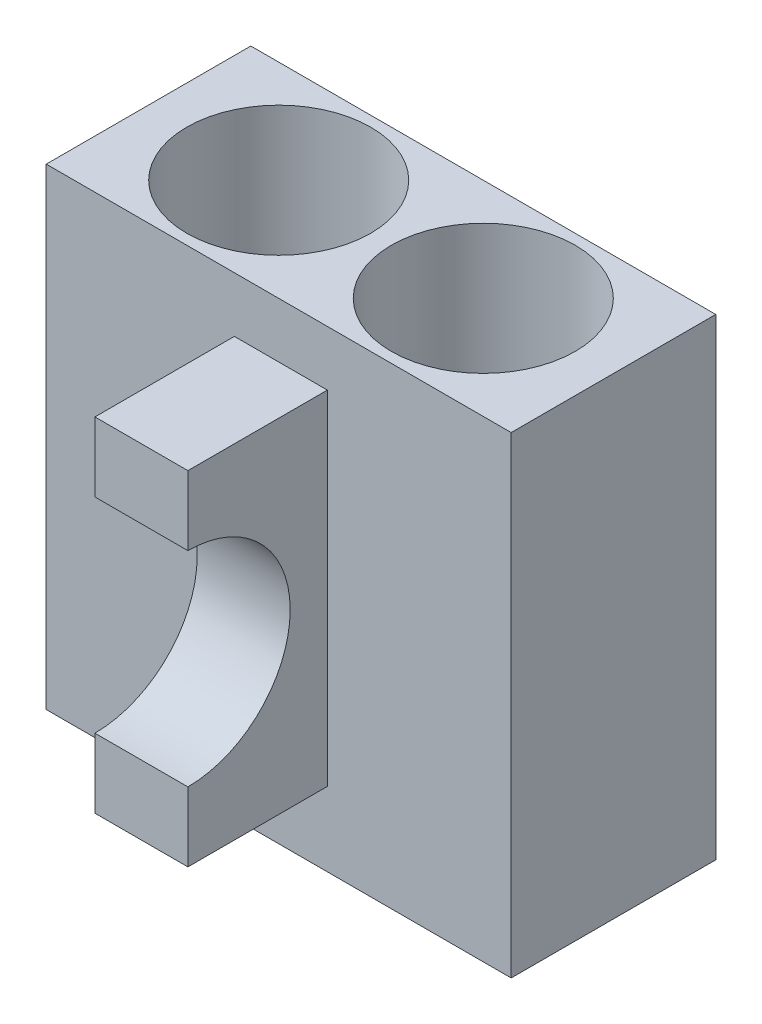
ISO-10303-21;
HEADER;
FILE_DESCRIPTION(('STEP AP214'),'2;1');
FILE_NAME('part.step','',(''),(''),'','','');
FILE_SCHEMA(('AUTOMOTIVE_DESIGN { 1 0 10303 214 1 1 1 1 }'));
ENDSEC;
DATA;
#1=APPLICATION_CONTEXT('core data for automotive mechanical design processes');
#2=APPLICATION_PROTOCOL_DEFINITION('international standard','automotive_design',2000,#1);
#3=PRODUCT_CONTEXT('',#1,'mechanical');
#4=PRODUCT('Part','Part','',(#3));
#5=PRODUCT_RELATED_PRODUCT_CATEGORY('part','',(#4));
#6=PRODUCT_DEFINITION_FORMATION('','',#4);
#7=PRODUCT_DEFINITION_CONTEXT('part definition',#1,'design');
#8=PRODUCT_DEFINITION('design','',#6,#7);
#9=PRODUCT_DEFINITION_SHAPE('','',#8);
#10=(LENGTH_UNIT() NAMED_UNIT(*) SI_UNIT(.MILLI.,.METRE.));
#11=(NAMED_UNIT(*) PLANE_ANGLE_UNIT() SI_UNIT($,.RADIAN.));
#12=(NAMED_UNIT(*) SI_UNIT($,.STERADIAN.) SOLID_ANGLE_UNIT());
#13=UNCERTAINTY_MEASURE_WITH_UNIT(LENGTH_MEASURE(1.E-05),#10,'distance_accuracy_value','');
#14=(GEOMETRIC_REPRESENTATION_CONTEXT(3) GLOBAL_UNCERTAINTY_ASSIGNED_CONTEXT((#13)) GLOBAL_UNIT_ASSIGNED_CONTEXT((#10,
#11,#12)) REPRESENTATION_CONTEXT('',''));
#15=CARTESIAN_POINT('',(0.,0.,0.));
#16=DIRECTION('',(0.,0.,1.));
#17=DIRECTION('',(1.,0.,0.));
#18=AXIS2_PLACEMENT_3D('',#15,#16,#17);
#19=CARTESIAN_POINT('',(0.,0.,26.2362852999536));
#20=DIRECTION('',(0.,0.,1.));
#21=DIRECTION('',(1.,0.,0.));
#22=AXIS2_PLACEMENT_3D('',#19,#20,#21);
#23=PLANE('',#22);
#24=DIRECTION('',(1.,0.,0.));
#25=VECTOR('',#24,1.);
#26=CARTESIAN_POINT('',(0.23138121745496,15.4165798344945,26.2362852999536));
#27=LINE('',#26,#25);
#28=CARTESIAN_POINT('',(0.23138121745496,15.4165798344945,26.2362852999536));
#29=VERTEX_POINT('',#28);
#30=CARTESIAN_POINT('',(10.231381217455,15.4165798344945,26.2362852999536));
#31=VERTEX_POINT('',#30);
#32=EDGE_CURVE('E11',#29,#31,#27,.T.);
#33=ORIENTED_EDGE('',*,*,#32,.F.);
#34=DIRECTION('',(0.,-1.,0.));
#35=VECTOR('',#34,1.);
#36=CARTESIAN_POINT('',(0.23138121745496,44.8715798344945,26.2362852999536));
#37=LINE('',#36,#35);
#38=CARTESIAN_POINT('',(0.23138121745496,7.96157983449446,26.2362852999536));
#39=VERTEX_POINT('',#38);
#40=EDGE_CURVE('E145',#29,#39,#37,.T.);
#41=ORIENTED_EDGE('',*,*,#40,.T.);
#42=DIRECTION('',(1.,0.,0.));
#43=VECTOR('',#42,1.);
#44=CARTESIAN_POINT('',(0.23138121745496,7.96157983449446,26.2362852999536));
#45=LINE('',#44,#43);
#46=CARTESIAN_POINT('',(10.231381217455,7.96157983449446,26.2362852999536));
#47=VERTEX_POINT('',#46);
#48=EDGE_CURVE('E127',#39,#47,#45,.T.);
#49=ORIENTED_EDGE('',*,*,#48,.T.);
#50=DIRECTION('',(0.,1.,0.));
#51=VECTOR('',#50,1.);
#52=CARTESIAN_POINT('',(10.231381217455,44.8715798344945,26.2362852999536));
#53=LINE('',#52,#51);
#54=EDGE_CURVE('E122',#47,#31,#53,.T.);
#55=ORIENTED_EDGE('',*,*,#54,.T.);
#56=EDGE_LOOP('',(#33,#41,#49,#55));
#57=FACE_BOUND('',#56,.T.);
#58=ADVANCED_FACE('F37',(#57),#23,.T.);
#59=CARTESIAN_POINT('',(-20.0017448058538,50.8,11.2362852999536));
#60=DIRECTION('',(0.,0.,-1.));
#61=DIRECTION('',(-1.,0.,0.));
#62=AXIS2_PLACEMENT_3D('',#59,#60,#61);
#63=PLANE('',#62);
#64=DIRECTION('',(1.,0.,0.));
#65=VECTOR('',#64,1.);
#66=CARTESIAN_POINT('',(-20.0017448058538,0.,11.2362852999536));
#67=LINE('',#66,#65);
#68=CARTESIAN_POINT('',(-20.0017448058538,0.,11.2362852999536));
#69=VERTEX_POINT('',#68);
#70=CARTESIAN_POINT('',(29.9982551941462,0.,11.2362852999536));
#71=VERTEX_POINT('',#70);
#72=EDGE_CURVE('E176',#69,#71,#67,.T.);
#73=ORIENTED_EDGE('',*,*,#72,.T.);
#74=DIRECTION('',(0.,-1.,0.));
#75=VECTOR('',#74,1.);
#76=CARTESIAN_POINT('',(29.9982551941462,50.8,11.2362852999536));
#77=LINE('',#76,#75);
#78=CARTESIAN_POINT('',(29.9982551941462,50.8,11.2362852999536));
#79=VERTEX_POINT('',#78);
#80=EDGE_CURVE('E186',#79,#71,#77,.T.);
#81=ORIENTED_EDGE('',*,*,#80,.F.);
#82=DIRECTION('',(1.,0.,0.));
#83=VECTOR('',#82,1.);
#84=CARTESIAN_POINT('',(-20.0017448058538,50.8,11.2362852999536));
#85=LINE('',#84,#83);
#86=CARTESIAN_POINT('',(-20.0017448058538,50.8,11.2362852999536));
#87=VERTEX_POINT('',#86);
#88=EDGE_CURVE('E166',#87,#79,#85,.T.);
#89=ORIENTED_EDGE('',*,*,#88,.F.);
#90=DIRECTION('',(0.,-1.,0.));
#91=VECTOR('',#90,1.);
#92=CARTESIAN_POINT('',(-20.0017448058538,50.8,11.2362852999536));
#93=LINE('',#92,#91);
#94=EDGE_CURVE('E189',#87,#69,#93,.T.);
#95=ORIENTED_EDGE('',*,*,#94,.T.);
#96=EDGE_LOOP('',(#73,#81,#89,#95));
#97=FACE_BOUND('',#96,.T.);
#98=DIRECTION('',(0.,-1.,0.));
#99=VECTOR('',#98,1.);
#100=CARTESIAN_POINT('',(0.23138121745496,44.8715798344945,11.2362852999536));
#101=LINE('',#100,#99);
#102=CARTESIAN_POINT('',(0.23138121745496,44.8715798344945,11.2362852999536));
#103=VERTEX_POINT('',#102);
#104=CARTESIAN_POINT('',(0.23138121745496,7.96157983449446,11.2362852999536));
#105=VERTEX_POINT('',#104);
#106=EDGE_CURVE('E59',#103,#105,#101,.T.);
#107=ORIENTED_EDGE('',*,*,#106,.F.);
#108=DIRECTION('',(-1.,0.,0.));
#109=VECTOR('',#108,1.);
#110=CARTESIAN_POINT('',(0.23138121745496,44.8715798344945,11.2362852999536));
#111=LINE('',#110,#109);
#112=CARTESIAN_POINT('',(10.231381217455,44.8715798344945,11.2362852999536));
#113=VERTEX_POINT('',#112);
#114=EDGE_CURVE('E143',#113,#103,#111,.T.);
#115=ORIENTED_EDGE('',*,*,#114,.F.);
#116=DIRECTION('',(0.,1.,0.));
#117=VECTOR('',#116,1.);
#118=CARTESIAN_POINT('',(10.231381217455,44.8715798344945,11.2362852999536));
#119=LINE('',#118,#117);
#120=CARTESIAN_POINT('',(10.231381217455,7.96157983449446,11.2362852999536));
#121=VERTEX_POINT('',#120);
#122=EDGE_CURVE('E140',#121,#113,#119,.T.);
#123=ORIENTED_EDGE('',*,*,#122,.F.);
#124=DIRECTION('',(1.,0.,0.));
#125=VECTOR('',#124,1.);
#126=CARTESIAN_POINT('',(0.23138121745496,7.96157983449446,11.2362852999536));
#127=LINE('',#126,#125);
#128=EDGE_CURVE('E137',#105,#121,#127,.T.);
#129=ORIENTED_EDGE('',*,*,#128,.F.);
#130=EDGE_LOOP('',(#107,#115,#123,#129));
#131=FACE_BOUND('',#130,.T.);
#132=ADVANCED_FACE('F212',(#97,#131),#63,.F.);
#133=CARTESIAN_POINT('',(0.,50.8,0.));
#134=DIRECTION('',(0.,1.,0.));
#135=DIRECTION('',(0.,0.,1.));
#136=AXIS2_PLACEMENT_3D('',#133,#134,#135);
#137=PLANE('',#136);
#138=CARTESIAN_POINT('',(-6.00174480585379,50.8,0.236285299953624));
#139=DIRECTION('',(0.,1.,0.));
#140=DIRECTION('',(0.,0.,1.));
#141=AXIS2_PLACEMENT_3D('',#138,#139,#140);
#142=CIRCLE('',#141,9.89);
#143=CARTESIAN_POINT('',(-6.00174480585379,50.8,10.1262852999536));
#144=VERTEX_POINT('',#143);
#145=EDGE_CURVE('E159',#144,#144,#142,.T.);
#146=ORIENTED_EDGE('',*,*,#145,.F.);
#147=EDGE_LOOP('',(#146));
#148=FACE_BOUND('',#147,.T.);
#149=DIRECTION('',(0.,0.,1.));
#150=VECTOR('',#149,1.);
#151=CARTESIAN_POINT('',(-20.0017448058538,50.8,-10.7637147000464));
#152=LINE('',#151,#150);
#153=CARTESIAN_POINT('',(-20.0017448058538,50.8,-10.7637147000464));
#154=VERTEX_POINT('',#153);
#155=EDGE_CURVE('E163',#154,#87,#152,.T.);
#156=ORIENTED_EDGE('',*,*,#155,.T.);
#157=ORIENTED_EDGE('',*,*,#88,.T.);
#158=DIRECTION('',(0.,0.,-1.));
#159=VECTOR('',#158,1.);
#160=CARTESIAN_POINT('',(29.9982551941462,50.8,-10.7637147000464));
#161=LINE('',#160,#159);
#162=CARTESIAN_POINT('',(29.9982551941462,50.8,-10.7637147000464));
#163=VERTEX_POINT('',#162);
#164=EDGE_CURVE('E169',#79,#163,#161,.T.);
#165=ORIENTED_EDGE('',*,*,#164,.T.);
#166=DIRECTION('',(-1.,0.,0.));
#167=VECTOR('',#166,1.);
#168=CARTESIAN_POINT('',(-20.0017448058538,50.8,-10.7637147000464));
#169=LINE('',#168,#167);
#170=EDGE_CURVE('E171',#163,#154,#169,.T.);
#171=ORIENTED_EDGE('',*,*,#170,.T.);
#172=EDGE_LOOP('',(#156,#157,#165,#171));
#173=FACE_BOUND('',#172,.T.);
#174=CARTESIAN_POINT('',(15.9982551941462,50.8,0.236285299953622));
#175=DIRECTION('',(0.,1.,0.));
#176=DIRECTION('',(0.,0.,1.));
#177=AXIS2_PLACEMENT_3D('',#174,#175,#176);
#178=CIRCLE('',#177,9.89);
#179=CARTESIAN_POINT('',(15.9982551941462,50.8,10.1262852999536));
#180=VERTEX_POINT('',#179);
#181=EDGE_CURVE('E156',#180,#180,#178,.T.);
#182=ORIENTED_EDGE('',*,*,#181,.F.);
#183=EDGE_LOOP('',(#182));
#184=FACE_BOUND('',#183,.T.);
#185=ADVANCED_FACE('F214',(#148,#173,#184),#137,.T.);
#186=CARTESIAN_POINT('',(0.,0.,0.));
#187=DIRECTION('',(0.,1.,0.));
#188=DIRECTION('',(0.,0.,1.));
#189=AXIS2_PLACEMENT_3D('',#186,#187,#188);
#190=PLANE('',#189);
#191=DIRECTION('',(0.,0.,1.));
#192=VECTOR('',#191,1.);
#193=CARTESIAN_POINT('',(-20.0017448058538,0.,-10.7637147000464));
#194=LINE('',#193,#192);
#195=CARTESIAN_POINT('',(-20.0017448058538,0.,-10.7637147000464));
#196=VERTEX_POINT('',#195);
#197=EDGE_CURVE('E162',#196,#69,#194,.T.);
#198=ORIENTED_EDGE('',*,*,#197,.F.);
#199=DIRECTION('',(-1.,0.,0.));
#200=VECTOR('',#199,1.);
#201=CARTESIAN_POINT('',(-20.0017448058538,0.,-10.7637147000464));
#202=LINE('',#201,#200);
#203=CARTESIAN_POINT('',(29.9982551941462,0.,-10.7637147000464));
#204=VERTEX_POINT('',#203);
#205=EDGE_CURVE('E167',#204,#196,#202,.T.);
#206=ORIENTED_EDGE('',*,*,#205,.F.);
#207=DIRECTION('',(0.,0.,-1.));
#208=VECTOR('',#207,1.);
#209=CARTESIAN_POINT('',(29.9982551941462,0.,-10.7637147000464));
#210=LINE('',#209,#208);
#211=EDGE_CURVE('E178',#71,#204,#210,.T.);
#212=ORIENTED_EDGE('',*,*,#211,.F.);
#213=ORIENTED_EDGE('',*,*,#72,.F.);
#214=EDGE_LOOP('',(#198,#206,#212,#213));
#215=FACE_BOUND('',#214,.T.);
#216=ADVANCED_FACE('F220',(#215),#190,.F.);
#217=CARTESIAN_POINT('',(-20.0017448058538,50.8,-10.7637147000464));
#218=DIRECTION('',(1.,0.,0.));
#219=DIRECTION('',(0.,0.,-1.));
#220=AXIS2_PLACEMENT_3D('',#217,#218,#219);
#221=PLANE('',#220);
#222=ORIENTED_EDGE('',*,*,#197,.T.);
#223=ORIENTED_EDGE('',*,*,#94,.F.);
#224=ORIENTED_EDGE('',*,*,#155,.F.);
#225=DIRECTION('',(0.,-1.,0.));
#226=VECTOR('',#225,1.);
#227=CARTESIAN_POINT('',(-20.0017448058538,50.8,-10.7637147000464));
#228=LINE('',#227,#226);
#229=EDGE_CURVE('E173',#154,#196,#228,.T.);
#230=ORIENTED_EDGE('',*,*,#229,.T.);
#231=EDGE_LOOP('',(#222,#223,#224,#230));
#232=FACE_BOUND('',#231,.T.);
#233=ADVANCED_FACE('F39',(#232),#221,.F.);
#234=CARTESIAN_POINT('',(29.9982551941462,50.8,-10.7637147000464));
#235=DIRECTION('',(-1.,0.,0.));
#236=DIRECTION('',(0.,0.,1.));
#237=AXIS2_PLACEMENT_3D('',#234,#235,#236);
#238=PLANE('',#237);
#239=ORIENTED_EDGE('',*,*,#211,.T.);
#240=DIRECTION('',(0.,-1.,0.));
#241=VECTOR('',#240,1.);
#242=CARTESIAN_POINT('',(29.9982551941462,50.8,-10.7637147000464));
#243=LINE('',#242,#241);
#244=EDGE_CURVE('E183',#163,#204,#243,.T.);
#245=ORIENTED_EDGE('',*,*,#244,.F.);
#246=ORIENTED_EDGE('',*,*,#164,.F.);
#247=ORIENTED_EDGE('',*,*,#80,.T.);
#248=EDGE_LOOP('',(#239,#245,#246,#247));
#249=FACE_BOUND('',#248,.T.);
#250=ADVANCED_FACE('F225',(#249),#238,.F.);
#251=CARTESIAN_POINT('',(-20.0017448058538,50.8,-10.7637147000464));
#252=DIRECTION('',(0.,0.,1.));
#253=DIRECTION('',(1.,0.,0.));
#254=AXIS2_PLACEMENT_3D('',#251,#252,#253);
#255=PLANE('',#254);
#256=ORIENTED_EDGE('',*,*,#205,.T.);
#257=ORIENTED_EDGE('',*,*,#229,.F.);
#258=ORIENTED_EDGE('',*,*,#170,.F.);
#259=ORIENTED_EDGE('',*,*,#244,.T.);
#260=EDGE_LOOP('',(#256,#257,#258,#259));
#261=FACE_BOUND('',#260,.T.);
#262=ADVANCED_FACE('F228',(#261),#255,.F.);
#263=CARTESIAN_POINT('',(-6.00174480585379,50.8,0.236285299953624));
#264=DIRECTION('',(0.,-1.,0.));
#265=DIRECTION('',(0.,0.,-1.));
#266=AXIS2_PLACEMENT_3D('',#263,#264,#265);
#267=CYLINDRICAL_SURFACE('',#266,9.89);
#268=CARTESIAN_POINT('',(-6.00174480585379,1.,0.236285299953624));
#269=DIRECTION('',(0.,1.,0.));
#270=DIRECTION('',(0.,0.,1.));
#271=AXIS2_PLACEMENT_3D('',#268,#269,#270);
#272=CIRCLE('',#271,9.89);
#273=CARTESIAN_POINT('',(-6.00174480585379,1.,10.1262852999536));
#274=VERTEX_POINT('',#273);
#275=EDGE_CURVE('E192',#274,#274,#272,.T.);
#276=ORIENTED_EDGE('',*,*,#275,.F.);
#277=EDGE_LOOP('',(#276));
#278=FACE_BOUND('',#277,.T.);
#279=ORIENTED_EDGE('',*,*,#145,.T.);
#280=EDGE_LOOP('',(#279));
#281=FACE_BOUND('',#280,.T.);
#282=ADVANCED_FACE('F232',(#278,#281),#267,.F.);
#283=CARTESIAN_POINT('',(15.9982551941462,50.8,0.236285299953622));
#284=DIRECTION('',(0.,-1.,0.));
#285=DIRECTION('',(0.,0.,-1.));
#286=AXIS2_PLACEMENT_3D('',#283,#284,#285);
#287=CYLINDRICAL_SURFACE('',#286,9.89);
#288=CARTESIAN_POINT('',(15.9982551941462,7.35,0.236285299953622));
#289=DIRECTION('',(0.,1.,0.));
#290=DIRECTION('',(0.,0.,1.));
#291=AXIS2_PLACEMENT_3D('',#288,#289,#290);
#292=CIRCLE('',#291,9.89);
#293=CARTESIAN_POINT('',(15.9982551941462,7.35,10.1262852999536));
#294=VERTEX_POINT('',#293);
#295=EDGE_CURVE('E195',#294,#294,#292,.T.);
#296=ORIENTED_EDGE('',*,*,#295,.F.);
#297=EDGE_LOOP('',(#296));
#298=FACE_BOUND('',#297,.T.);
#299=ORIENTED_EDGE('',*,*,#181,.T.);
#300=EDGE_LOOP('',(#299));
#301=FACE_BOUND('',#300,.T.);
#302=ADVANCED_FACE('F239',(#298,#301),#287,.F.);
#303=CARTESIAN_POINT('',(-6.00174480585379,1.,0.236285299953624));
#304=DIRECTION('',(0.,1.,0.));
#305=DIRECTION('',(0.,0.,1.));
#306=AXIS2_PLACEMENT_3D('',#303,#304,#305);
#307=PLANE('',#306);
#308=ORIENTED_EDGE('',*,*,#275,.T.);
#309=EDGE_LOOP('',(#308));
#310=FACE_BOUND('',#309,.T.);
#311=ADVANCED_FACE('F243',(#310),#307,.T.);
#312=CARTESIAN_POINT('',(15.7037353743303,7.35,0.));
#313=DIRECTION('',(0.,1.,0.));
#314=DIRECTION('',(0.,0.,1.));
#315=AXIS2_PLACEMENT_3D('',#312,#313,#314);
#316=PLANE('',#315);
#317=ORIENTED_EDGE('',*,*,#295,.T.);
#318=EDGE_LOOP('',(#317));
#319=FACE_BOUND('',#318,.T.);
#320=ADVANCED_FACE('F247',(#319),#316,.T.);
#321=CARTESIAN_POINT('',(0.23138121745496,44.8715798344945,26.2362852999536));
#322=DIRECTION('',(1.,0.,0.));
#323=DIRECTION('',(0.,0.,-1.));
#324=AXIS2_PLACEMENT_3D('',#321,#322,#323);
#325=PLANE('',#324);
#326=ORIENTED_EDGE('',*,*,#40,.F.);
#327=CARTESIAN_POINT('',(0.23138121745496,26.4165798344945,26.2362852999536));
#328=DIRECTION('',(1.,0.,0.));
#329=DIRECTION('',(0.,0.,-1.));
#330=AXIS2_PLACEMENT_3D('',#327,#328,#329);
#331=CIRCLE('',#330,11.);
#332=CARTESIAN_POINT('',(0.23138121745496,37.4165798344945,26.2362852999536));
#333=VERTEX_POINT('',#332);
#334=EDGE_CURVE('E113',#29,#333,#331,.T.);
#335=ORIENTED_EDGE('',*,*,#334,.T.);
#336=CARTESIAN_POINT('',(0.23138121745496,44.8715798344945,26.2362852999536));
#337=VERTEX_POINT('',#336);
#338=EDGE_CURVE('E202',#337,#333,#37,.T.);
#339=ORIENTED_EDGE('',*,*,#338,.F.);
#340=DIRECTION('',(0.,0.,-1.));
#341=VECTOR('',#340,1.);
#342=CARTESIAN_POINT('',(0.23138121745496,44.8715798344945,26.2362852999536));
#343=LINE('',#342,#341);
#344=EDGE_CURVE('E131',#337,#103,#343,.T.);
#345=ORIENTED_EDGE('',*,*,#344,.T.);
#346=ORIENTED_EDGE('',*,*,#106,.T.);
#347=DIRECTION('',(0.,0.,-1.));
#348=VECTOR('',#347,1.);
#349=CARTESIAN_POINT('',(0.23138121745496,7.96157983449446,26.2362852999536));
#350=LINE('',#349,#348);
#351=EDGE_CURVE('E153',#39,#105,#350,.T.);
#352=ORIENTED_EDGE('',*,*,#351,.F.);
#353=EDGE_LOOP('',(#326,#335,#339,#345,#346,#352));
#354=FACE_BOUND('',#353,.T.);
#355=ADVANCED_FACE('F201',(#354),#325,.F.);
#356=CARTESIAN_POINT('',(0.23138121745496,7.96157983449446,26.2362852999536));
#357=DIRECTION('',(0.,1.,0.));
#358=DIRECTION('',(0.,0.,1.));
#359=AXIS2_PLACEMENT_3D('',#356,#357,#358);
#360=PLANE('',#359);
#361=ORIENTED_EDGE('',*,*,#128,.T.);
#362=DIRECTION('',(0.,0.,-1.));
#363=VECTOR('',#362,1.);
#364=CARTESIAN_POINT('',(10.231381217455,7.96157983449446,26.2362852999536));
#365=LINE('',#364,#363);
#366=EDGE_CURVE('E151',#47,#121,#365,.T.);
#367=ORIENTED_EDGE('',*,*,#366,.F.);
#368=ORIENTED_EDGE('',*,*,#48,.F.);
#369=ORIENTED_EDGE('',*,*,#351,.T.);
#370=EDGE_LOOP('',(#361,#367,#368,#369));
#371=FACE_BOUND('',#370,.T.);
#372=ADVANCED_FACE('F209',(#371),#360,.F.);
#373=CARTESIAN_POINT('',(10.231381217455,44.8715798344945,26.2362852999536));
#374=DIRECTION('',(-1.,0.,0.));
#375=DIRECTION('',(0.,0.,1.));
#376=AXIS2_PLACEMENT_3D('',#373,#374,#375);
#377=PLANE('',#376);
#378=CARTESIAN_POINT('',(10.231381217455,37.4165798344945,26.2362852999536));
#379=VERTEX_POINT('',#378);
#380=CARTESIAN_POINT('',(10.231381217455,44.8715798344945,26.2362852999536));
#381=VERTEX_POINT('',#380);
#382=EDGE_CURVE('E124',#379,#381,#53,.T.);
#383=ORIENTED_EDGE('',*,*,#382,.F.);
#384=CARTESIAN_POINT('',(10.231381217455,26.4165798344945,26.2362852999536));
#385=DIRECTION('',(1.,0.,0.));
#386=DIRECTION('',(0.,0.,-1.));
#387=AXIS2_PLACEMENT_3D('',#384,#385,#386);
#388=CIRCLE('',#387,11.);
#389=EDGE_CURVE('E51',#31,#379,#388,.T.);
#390=ORIENTED_EDGE('',*,*,#389,.F.);
#391=ORIENTED_EDGE('',*,*,#54,.F.);
#392=ORIENTED_EDGE('',*,*,#366,.T.);
#393=ORIENTED_EDGE('',*,*,#122,.T.);
#394=DIRECTION('',(0.,0.,-1.));
#395=VECTOR('',#394,1.);
#396=CARTESIAN_POINT('',(10.231381217455,44.8715798344945,26.2362852999536));
#397=LINE('',#396,#395);
#398=EDGE_CURVE('E148',#381,#113,#397,.T.);
#399=ORIENTED_EDGE('',*,*,#398,.F.);
#400=EDGE_LOOP('',(#383,#390,#391,#392,#393,#399));
#401=FACE_BOUND('',#400,.T.);
#402=ADVANCED_FACE('F120',(#401),#377,.F.);
#403=CARTESIAN_POINT('',(0.23138121745496,44.8715798344945,26.2362852999536));
#404=DIRECTION('',(0.,-1.,0.));
#405=DIRECTION('',(1.,0.,0.));
#406=AXIS2_PLACEMENT_3D('',#403,#404,#405);
#407=PLANE('',#406);
#408=ORIENTED_EDGE('',*,*,#114,.T.);
#409=ORIENTED_EDGE('',*,*,#344,.F.);
#410=DIRECTION('',(-1.,0.,0.));
#411=VECTOR('',#410,1.);
#412=CARTESIAN_POINT('',(0.23138121745496,44.8715798344945,26.2362852999536));
#413=LINE('',#412,#411);
#414=EDGE_CURVE('E129',#381,#337,#413,.T.);
#415=ORIENTED_EDGE('',*,*,#414,.F.);
#416=ORIENTED_EDGE('',*,*,#398,.T.);
#417=EDGE_LOOP('',(#408,#409,#415,#416));
#418=FACE_BOUND('',#417,.T.);
#419=ADVANCED_FACE('F211',(#418),#407,.F.);
#420=DIRECTION('',(1.,0.,0.));
#421=VECTOR('',#420,1.);
#422=CARTESIAN_POINT('',(0.23138121745496,37.4165798344945,26.2362852999536));
#423=LINE('',#422,#421);
#424=EDGE_CURVE('E45',#379,#333,#423,.F.);
#425=ORIENTED_EDGE('',*,*,#424,.F.);
#426=ORIENTED_EDGE('',*,*,#382,.T.);
#427=ORIENTED_EDGE('',*,*,#414,.T.);
#428=ORIENTED_EDGE('',*,*,#338,.T.);
#429=EDGE_LOOP('',(#425,#426,#427,#428));
#430=FACE_BOUND('',#429,.T.);
#431=ADVANCED_FACE('F205',(#430),#23,.T.);
#432=CARTESIAN_POINT('',(0.23138121745496,26.4165798344945,26.2362852999536));
#433=DIRECTION('',(1.,0.,0.));
#434=DIRECTION('',(0.,0.,-1.));
#435=AXIS2_PLACEMENT_3D('',#432,#433,#434);
#436=CYLINDRICAL_SURFACE('',#435,11.);
#437=ORIENTED_EDGE('',*,*,#32,.T.);
#438=ORIENTED_EDGE('',*,*,#389,.T.);
#439=ORIENTED_EDGE('',*,*,#424,.T.);
#440=ORIENTED_EDGE('',*,*,#334,.F.);
#441=EDGE_LOOP('',(#437,#438,#439,#440));
#442=FACE_BOUND('',#441,.T.);
#443=ADVANCED_FACE('F111',(#442),#436,.F.);
#444=CLOSED_SHELL('',(#58,#132,#185,#216,#233,#250,#262,#282,#302,#311,#320,#355,#372,#402,#419,
#431,#443));
#445=MANIFOLD_SOLID_BREP('B2',#444);
#446=ADVANCED_BREP_SHAPE_REPRESENTATION('',(#18,#445),#14);
#447=SHAPE_DEFINITION_REPRESENTATION(#9,#446);
ENDSEC;
END-ISO-10303-21;
